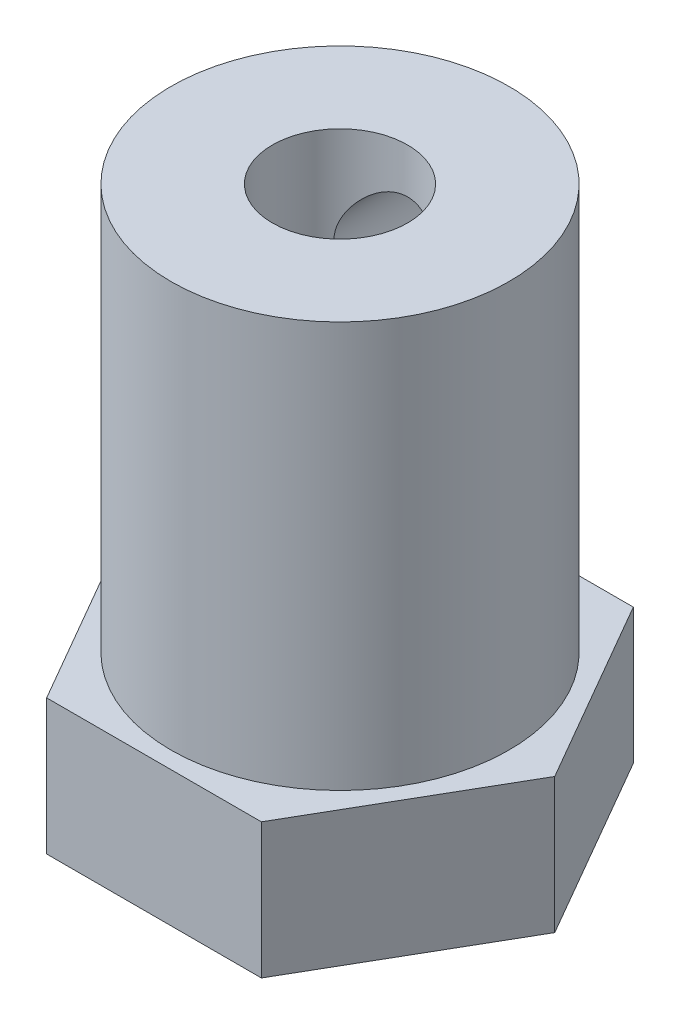
ISO-10303-21;
HEADER;
FILE_DESCRIPTION(('STEP AP214'),'2;1');
FILE_NAME('part.step','',(''),(''),'','','');
FILE_SCHEMA(('AUTOMOTIVE_DESIGN { 1 0 10303 214 1 1 1 1 }'));
ENDSEC;
DATA;
#1=APPLICATION_CONTEXT('core data for automotive mechanical design processes');
#2=APPLICATION_PROTOCOL_DEFINITION('international standard','automotive_design',2000,#1);
#3=PRODUCT_CONTEXT('',#1,'mechanical');
#4=PRODUCT('Part','Part','',(#3));
#5=PRODUCT_RELATED_PRODUCT_CATEGORY('part','',(#4));
#6=PRODUCT_DEFINITION_FORMATION('','',#4);
#7=PRODUCT_DEFINITION_CONTEXT('part definition',#1,'design');
#8=PRODUCT_DEFINITION('design','',#6,#7);
#9=PRODUCT_DEFINITION_SHAPE('','',#8);
#10=(LENGTH_UNIT() NAMED_UNIT(*) SI_UNIT(.MILLI.,.METRE.));
#11=(NAMED_UNIT(*) PLANE_ANGLE_UNIT() SI_UNIT($,.RADIAN.));
#12=(NAMED_UNIT(*) SI_UNIT($,.STERADIAN.) SOLID_ANGLE_UNIT());
#13=UNCERTAINTY_MEASURE_WITH_UNIT(LENGTH_MEASURE(1.E-05),#10,'distance_accuracy_value','');
#14=(GEOMETRIC_REPRESENTATION_CONTEXT(3) GLOBAL_UNCERTAINTY_ASSIGNED_CONTEXT((#13)) GLOBAL_UNIT_ASSIGNED_CONTEXT((#10,
#11,#12)) REPRESENTATION_CONTEXT('',''));
#15=CARTESIAN_POINT('',(0.,0.,0.));
#16=DIRECTION('',(0.,0.,1.));
#17=DIRECTION('',(1.,0.,0.));
#18=AXIS2_PLACEMENT_3D('',#15,#16,#17);
#19=CARTESIAN_POINT('',(3.175426480543,4.,5.49999999999996));
#20=DIRECTION('',(-0.866025403784442,0.,-0.499999999999995));
#21=DIRECTION('',(-0.499999999999995,0.,0.866025403784442));
#22=AXIS2_PLACEMENT_3D('',#19,#20,#21);
#23=PLANE('',#22);
#24=DIRECTION('',(0.499999999999995,0.,-0.866025403784442));
#25=VECTOR('',#24,1.);
#26=CARTESIAN_POINT('',(3.175426480543,0.,5.49999999999996));
#27=LINE('',#26,#25);
#28=CARTESIAN_POINT('',(3.175426480543,0.,5.49999999999996));
#29=VERTEX_POINT('',#28);
#30=CARTESIAN_POINT('',(6.35085296108588,0.,0.));
#31=VERTEX_POINT('',#30);
#32=EDGE_CURVE('E123',#29,#31,#27,.T.);
#33=ORIENTED_EDGE('',*,*,#32,.T.);
#34=DIRECTION('',(0.,-1.,0.));
#35=VECTOR('',#34,1.);
#36=CARTESIAN_POINT('',(6.35085296108588,4.,0.));
#37=LINE('',#36,#35);
#38=CARTESIAN_POINT('',(6.35085296108588,4.,0.));
#39=VERTEX_POINT('',#38);
#40=EDGE_CURVE('E11',#39,#31,#37,.T.);
#41=ORIENTED_EDGE('',*,*,#40,.F.);
#42=DIRECTION('',(0.499999999999995,0.,-0.866025403784442));
#43=VECTOR('',#42,1.);
#44=CARTESIAN_POINT('',(3.175426480543,4.,5.49999999999996));
#45=LINE('',#44,#43);
#46=CARTESIAN_POINT('',(3.175426480543,4.,5.49999999999996));
#47=VERTEX_POINT('',#46);
#48=EDGE_CURVE('E134',#47,#39,#45,.T.);
#49=ORIENTED_EDGE('',*,*,#48,.F.);
#50=DIRECTION('',(0.,-1.,0.));
#51=VECTOR('',#50,1.);
#52=CARTESIAN_POINT('',(3.175426480543,4.,5.49999999999996));
#53=LINE('',#52,#51);
#54=EDGE_CURVE('E119',#47,#29,#53,.T.);
#55=ORIENTED_EDGE('',*,*,#54,.T.);
#56=EDGE_LOOP('',(#33,#41,#49,#55));
#57=FACE_BOUND('',#56,.T.);
#58=ADVANCED_FACE('F32',(#57),#23,.F.);
#59=CARTESIAN_POINT('',(6.35085296108588,4.,0.));
#60=DIRECTION('',(-0.866025403784438,0.,0.500000000000001));
#61=DIRECTION('',(0.500000000000001,0.,0.866025403784438));
#62=AXIS2_PLACEMENT_3D('',#59,#60,#61);
#63=PLANE('',#62);
#64=DIRECTION('',(-0.500000000000001,0.,-0.866025403784438));
#65=VECTOR('',#64,1.);
#66=CARTESIAN_POINT('',(6.35085296108588,0.,0.));
#67=LINE('',#66,#65);
#68=CARTESIAN_POINT('',(3.17542648054293,0.,-5.5));
#69=VERTEX_POINT('',#68);
#70=EDGE_CURVE('E126',#31,#69,#67,.T.);
#71=ORIENTED_EDGE('',*,*,#70,.T.);
#72=DIRECTION('',(0.,-1.,0.));
#73=VECTOR('',#72,1.);
#74=CARTESIAN_POINT('',(3.17542648054293,4.,-5.5));
#75=LINE('',#74,#73);
#76=CARTESIAN_POINT('',(3.17542648054293,4.,-5.5));
#77=VERTEX_POINT('',#76);
#78=EDGE_CURVE('E46',#77,#69,#75,.T.);
#79=ORIENTED_EDGE('',*,*,#78,.F.);
#80=DIRECTION('',(-0.500000000000001,0.,-0.866025403784438));
#81=VECTOR('',#80,1.);
#82=CARTESIAN_POINT('',(6.35085296108588,4.,0.));
#83=LINE('',#82,#81);
#84=EDGE_CURVE('E92',#39,#77,#83,.T.);
#85=ORIENTED_EDGE('',*,*,#84,.F.);
#86=ORIENTED_EDGE('',*,*,#40,.T.);
#87=EDGE_LOOP('',(#71,#79,#85,#86));
#88=FACE_BOUND('',#87,.T.);
#89=ADVANCED_FACE('F164',(#88),#63,.F.);
#90=CARTESIAN_POINT('',(3.17542648054293,4.,-5.5));
#91=DIRECTION('',(0.,0.,1.));
#92=DIRECTION('',(1.,0.,0.));
#93=AXIS2_PLACEMENT_3D('',#90,#91,#92);
#94=PLANE('',#93);
#95=DIRECTION('',(-1.,0.,0.));
#96=VECTOR('',#95,1.);
#97=CARTESIAN_POINT('',(3.17542648054293,0.,-5.5));
#98=LINE('',#97,#96);
#99=CARTESIAN_POINT('',(-3.17542648054296,0.,-5.49999999999998));
#100=VERTEX_POINT('',#99);
#101=EDGE_CURVE('E129',#69,#100,#98,.T.);
#102=ORIENTED_EDGE('',*,*,#101,.T.);
#103=DIRECTION('',(0.,-1.,0.));
#104=VECTOR('',#103,1.);
#105=CARTESIAN_POINT('',(-3.17542648054296,4.,-5.49999999999998));
#106=LINE('',#105,#104);
#107=CARTESIAN_POINT('',(-3.17542648054296,4.,-5.49999999999998));
#108=VERTEX_POINT('',#107);
#109=EDGE_CURVE('E114',#108,#100,#106,.T.);
#110=ORIENTED_EDGE('',*,*,#109,.F.);
#111=DIRECTION('',(-1.,0.,0.));
#112=VECTOR('',#111,1.);
#113=CARTESIAN_POINT('',(3.17542648054293,4.,-5.5));
#114=LINE('',#113,#112);
#115=EDGE_CURVE('E105',#77,#108,#114,.T.);
#116=ORIENTED_EDGE('',*,*,#115,.F.);
#117=ORIENTED_EDGE('',*,*,#78,.T.);
#118=EDGE_LOOP('',(#102,#110,#116,#117));
#119=FACE_BOUND('',#118,.T.);
#120=ADVANCED_FACE('F167',(#119),#94,.F.);
#121=CARTESIAN_POINT('',(-3.17542648054296,4.,-5.49999999999998));
#122=DIRECTION('',(0.866025403784441,0.,0.499999999999995));
#123=DIRECTION('',(0.499999999999995,0.,-0.866025403784442));
#124=AXIS2_PLACEMENT_3D('',#121,#122,#123);
#125=PLANE('',#124);
#126=DIRECTION('',(-0.499999999999995,0.,0.866025403784441));
#127=VECTOR('',#126,1.);
#128=CARTESIAN_POINT('',(-3.17542648054296,0.,-5.49999999999998));
#129=LINE('',#128,#127);
#130=CARTESIAN_POINT('',(-6.35085296108588,0.,0.));
#131=VERTEX_POINT('',#130);
#132=EDGE_CURVE('E113',#100,#131,#129,.T.);
#133=ORIENTED_EDGE('',*,*,#132,.T.);
#134=DIRECTION('',(0.,-1.,0.));
#135=VECTOR('',#134,1.);
#136=CARTESIAN_POINT('',(-6.35085296108588,4.,0.));
#137=LINE('',#136,#135);
#138=CARTESIAN_POINT('',(-6.35085296108588,4.,0.));
#139=VERTEX_POINT('',#138);
#140=EDGE_CURVE('E110',#139,#131,#137,.T.);
#141=ORIENTED_EDGE('',*,*,#140,.F.);
#142=DIRECTION('',(-0.499999999999995,0.,0.866025403784441));
#143=VECTOR('',#142,1.);
#144=CARTESIAN_POINT('',(-3.17542648054296,4.,-5.49999999999998));
#145=LINE('',#144,#143);
#146=EDGE_CURVE('E99',#108,#139,#145,.T.);
#147=ORIENTED_EDGE('',*,*,#146,.F.);
#148=ORIENTED_EDGE('',*,*,#109,.T.);
#149=EDGE_LOOP('',(#133,#141,#147,#148));
#150=FACE_BOUND('',#149,.T.);
#151=ADVANCED_FACE('F111',(#150),#125,.F.);
#152=CARTESIAN_POINT('',(-6.35085296108588,4.,0.));
#153=DIRECTION('',(0.866025403784434,0.,-0.500000000000007));
#154=DIRECTION('',(-0.500000000000007,0.,-0.866025403784434));
#155=AXIS2_PLACEMENT_3D('',#152,#153,#154);
#156=PLANE('',#155);
#157=DIRECTION('',(0.500000000000007,0.,0.866025403784434));
#158=VECTOR('',#157,1.);
#159=CARTESIAN_POINT('',(-6.35085296108588,0.,0.));
#160=LINE('',#159,#158);
#161=CARTESIAN_POINT('',(-3.17542648054289,0.,5.50000000000002));
#162=VERTEX_POINT('',#161);
#163=EDGE_CURVE('E78',#131,#162,#160,.T.);
#164=ORIENTED_EDGE('',*,*,#163,.T.);
#165=DIRECTION('',(0.,-1.,0.));
#166=VECTOR('',#165,1.);
#167=CARTESIAN_POINT('',(-3.17542648054289,4.,5.50000000000002));
#168=LINE('',#167,#166);
#169=CARTESIAN_POINT('',(-3.17542648054289,4.,5.50000000000002));
#170=VERTEX_POINT('',#169);
#171=EDGE_CURVE('E115',#170,#162,#168,.T.);
#172=ORIENTED_EDGE('',*,*,#171,.F.);
#173=DIRECTION('',(0.500000000000007,0.,0.866025403784434));
#174=VECTOR('',#173,1.);
#175=CARTESIAN_POINT('',(-6.35085296108588,4.,0.));
#176=LINE('',#175,#174);
#177=EDGE_CURVE('E103',#139,#170,#176,.T.);
#178=ORIENTED_EDGE('',*,*,#177,.F.);
#179=ORIENTED_EDGE('',*,*,#140,.T.);
#180=EDGE_LOOP('',(#164,#172,#178,#179));
#181=FACE_BOUND('',#180,.T.);
#182=ADVANCED_FACE('F117',(#181),#156,.F.);
#183=CARTESIAN_POINT('',(-3.17542648054289,4.,5.50000000000002));
#184=DIRECTION('',(0.,0.,-1.));
#185=DIRECTION('',(-1.,0.,0.));
#186=AXIS2_PLACEMENT_3D('',#183,#184,#185);
#187=PLANE('',#186);
#188=DIRECTION('',(1.,0.,0.));
#189=VECTOR('',#188,1.);
#190=CARTESIAN_POINT('',(-3.17542648054289,0.,5.50000000000002));
#191=LINE('',#190,#189);
#192=EDGE_CURVE('E84',#162,#29,#191,.T.);
#193=ORIENTED_EDGE('',*,*,#192,.T.);
#194=ORIENTED_EDGE('',*,*,#54,.F.);
#195=DIRECTION('',(1.,0.,0.));
#196=VECTOR('',#195,1.);
#197=CARTESIAN_POINT('',(-3.17542648054289,4.,5.50000000000002));
#198=LINE('',#197,#196);
#199=EDGE_CURVE('E55',#170,#47,#198,.T.);
#200=ORIENTED_EDGE('',*,*,#199,.F.);
#201=ORIENTED_EDGE('',*,*,#171,.T.);
#202=EDGE_LOOP('',(#193,#194,#200,#201));
#203=FACE_BOUND('',#202,.T.);
#204=ADVANCED_FACE('F172',(#203),#187,.F.);
#205=CARTESIAN_POINT('',(0.,4.,0.));
#206=DIRECTION('',(0.,1.,0.));
#207=DIRECTION('',(0.,0.,1.));
#208=AXIS2_PLACEMENT_3D('',#205,#206,#207);
#209=PLANE('',#208);
#210=CARTESIAN_POINT('',(0.,4.,0.));
#211=DIRECTION('',(0.,1.,0.));
#212=DIRECTION('',(0.,0.,1.));
#213=AXIS2_PLACEMENT_3D('',#210,#211,#212);
#214=CIRCLE('',#213,5.);
#215=CARTESIAN_POINT('',(0.,4.,5.));
#216=VERTEX_POINT('',#215);
#217=EDGE_CURVE('E141',#216,#216,#214,.T.);
#218=ORIENTED_EDGE('',*,*,#217,.F.);
#219=EDGE_LOOP('',(#218));
#220=FACE_BOUND('',#219,.T.);
#221=ORIENTED_EDGE('',*,*,#48,.T.);
#222=ORIENTED_EDGE('',*,*,#84,.T.);
#223=ORIENTED_EDGE('',*,*,#115,.T.);
#224=ORIENTED_EDGE('',*,*,#146,.T.);
#225=ORIENTED_EDGE('',*,*,#177,.T.);
#226=ORIENTED_EDGE('',*,*,#199,.T.);
#227=EDGE_LOOP('',(#221,#222,#223,#224,#225,#226));
#228=FACE_BOUND('',#227,.T.);
#229=ADVANCED_FACE('F101',(#220,#228),#209,.T.);
#230=CARTESIAN_POINT('',(0.,0.,0.));
#231=DIRECTION('',(0.,1.,0.));
#232=DIRECTION('',(0.,0.,1.));
#233=AXIS2_PLACEMENT_3D('',#230,#231,#232);
#234=PLANE('',#233);
#235=CARTESIAN_POINT('',(0.,0.,0.));
#236=DIRECTION('',(0.,1.,0.));
#237=DIRECTION('',(0.,0.,1.));
#238=AXIS2_PLACEMENT_3D('',#235,#236,#237);
#239=CIRCLE('',#238,2.);
#240=CARTESIAN_POINT('',(0.,0.,2.));
#241=VERTEX_POINT('',#240);
#242=EDGE_CURVE('E142',#241,#241,#239,.T.);
#243=ORIENTED_EDGE('',*,*,#242,.T.);
#244=EDGE_LOOP('',(#243));
#245=FACE_BOUND('',#244,.T.);
#246=ORIENTED_EDGE('',*,*,#32,.F.);
#247=ORIENTED_EDGE('',*,*,#192,.F.);
#248=ORIENTED_EDGE('',*,*,#163,.F.);
#249=ORIENTED_EDGE('',*,*,#132,.F.);
#250=ORIENTED_EDGE('',*,*,#101,.F.);
#251=ORIENTED_EDGE('',*,*,#70,.F.);
#252=EDGE_LOOP('',(#246,#247,#248,#249,#250,#251));
#253=FACE_BOUND('',#252,.T.);
#254=ADVANCED_FACE('F170',(#245,#253),#234,.F.);
#255=CARTESIAN_POINT('',(0.,16.,0.));
#256=DIRECTION('',(0.,-1.,0.));
#257=DIRECTION('',(0.,0.,-1.));
#258=AXIS2_PLACEMENT_3D('',#255,#256,#257);
#259=CYLINDRICAL_SURFACE('',#258,5.);
#260=CARTESIAN_POINT('',(0.,14.6698123528721,-5.));
#261=CARTESIAN_POINT('',(-0.0822886127532999,14.6698113553872,-4.9999992925055));
#262=CARTESIAN_POINT('',(-0.164587318351529,14.6630184892481,-4.99794915693954));
#263=CARTESIAN_POINT('',(-0.32678812530488,14.63609099865,-4.98997105593691));
#264=CARTESIAN_POINT('',(-0.406689504411419,14.6159523948488,-4.98404193389692));
#265=CARTESIAN_POINT('',(-0.561732707754525,14.5630663359618,-4.96895552501836));
#266=CARTESIAN_POINT('',(-0.636881364395372,14.5303374832532,-4.95980300250425));
#267=CARTESIAN_POINT('',(-0.780624181053129,14.4532762598163,-4.93922109237645));
#268=CARTESIAN_POINT('',(-0.849217467469667,14.4089423454767,-4.92779140192067));
#269=CARTESIAN_POINT('',(-0.979871797183742,14.3085883453994,-4.90350737192774));
#270=CARTESIAN_POINT('',(-1.04171807124434,14.2522957269862,-4.89062383657036));
#271=CARTESIAN_POINT('',(-1.15524920923323,14.1302031229619,-4.86505834210442));
#272=CARTESIAN_POINT('',(-1.2069323632744,14.0644015407471,-4.85237641724502));
#273=CARTESIAN_POINT('',(-1.29980037723707,13.9233415998345,-4.82834113993772));
#274=CARTESIAN_POINT('',(-1.34072309022213,13.8479038918814,-4.81702406663875));
#275=CARTESIAN_POINT('',(-1.4092139477476,13.6908230986418,-4.79743620394031));
#276=CARTESIAN_POINT('',(-1.43678529919972,13.6091815089441,-4.78916468313311));
#277=CARTESIAN_POINT('',(-1.47701633682651,13.4444220867416,-4.77690870838434));
#278=CARTESIAN_POINT('',(-1.49007196234676,13.3614096090082,-4.77281069324534));
#279=CARTESIAN_POINT('',(-1.50213730614671,13.1942791966553,-4.76902789749768));
#280=CARTESIAN_POINT('',(-1.50115042761077,13.110161534813,-4.76934204760572));
#281=CARTESIAN_POINT('',(-1.48546977199811,12.9464284442636,-4.77424744067778));
#282=CARTESIAN_POINT('',(-1.47127205262684,12.8667601025099,-4.77868388599141));
#283=CARTESIAN_POINT('',(-1.43037420427055,12.7109925665986,-4.79108356228625));
#284=CARTESIAN_POINT('',(-1.4036728414164,12.6348937254978,-4.79904714132351));
#285=CARTESIAN_POINT('',(-1.3381602665368,12.4872120032114,-4.81772733074973));
#286=CARTESIAN_POINT('',(-1.29918816934641,12.4157052689168,-4.82848016115953));
#287=CARTESIAN_POINT('',(-1.21035222588682,12.2800803308619,-4.85150987000065));
#288=CARTESIAN_POINT('',(-1.16048574002587,12.2159639234583,-4.86378711746991));
#289=CARTESIAN_POINT('',(-1.04881290765545,12.0941261621101,-4.88911011297938));
#290=CARTESIAN_POINT('',(-0.986594907466954,12.0367836888424,-4.90216654310498));
#291=CARTESIAN_POINT('',(-0.853263259313947,11.9332583688078,-4.92712244063259));
#292=CARTESIAN_POINT('',(-0.782149051860868,11.8870762244577,-4.9390218351841));
#293=CARTESIAN_POINT('',(-0.632355038342782,11.8069524304074,-4.96043160069471));
#294=CARTESIAN_POINT('',(-0.553627749747929,11.7730948366222,-4.96992543668314));
#295=CARTESIAN_POINT('',(-0.391245415603498,11.7192127627725,-4.98533521832222));
#296=CARTESIAN_POINT('',(-0.307591751589561,11.6991844243396,-4.99125216186999));
#297=CARTESIAN_POINT('',(-0.140952242668311,11.6741601749727,-4.99868364643538));
#298=CARTESIAN_POINT('',(-0.0580500976011665,11.6686507670705,-5.0003485041779));
#299=CARTESIAN_POINT('',(0.107499605823403,11.6713815085842,-4.9995292324176));
#300=CARTESIAN_POINT('',(0.190147196690801,11.6796198225235,-4.99704565677756));
#301=CARTESIAN_POINT('',(0.350903605309717,11.7091969639836,-4.98830696987163));
#302=CARTESIAN_POINT('',(0.42907277261419,11.730235740453,-4.98213829799417));
#303=CARTESIAN_POINT('',(0.580754638954542,11.7844555856503,-4.96674347841532));
#304=CARTESIAN_POINT('',(0.654266777025603,11.81763811391,-4.95751696321085));
#305=CARTESIAN_POINT('',(0.796437189461071,11.8960655183532,-4.93669654351324));
#306=CARTESIAN_POINT('',(0.864943826199688,11.9415716938201,-4.92505280829675));
#307=CARTESIAN_POINT('',(0.993523307980165,12.0430371069249,-4.90073468764317));
#308=CARTESIAN_POINT('',(1.05359403235595,12.0989989647598,-4.8880600443108));
#309=CARTESIAN_POINT('',(1.16585744551029,12.2221996612415,-4.86253171869138));
#310=CARTESIAN_POINT('',(1.21768481231505,12.2897742286439,-4.84968825033267));
#311=CARTESIAN_POINT('',(1.30928995072155,12.4329402918856,-4.82576515238463));
#312=CARTESIAN_POINT('',(1.34906803829473,12.5085315774303,-4.81468547654651));
#313=CARTESIAN_POINT('',(1.4151734712717,12.6653448441268,-4.79567189615055));
#314=CARTESIAN_POINT('',(1.44156346937051,12.7465385394087,-4.78772337843827));
#315=CARTESIAN_POINT('',(1.48021730815115,12.9125003218036,-4.77591594362794));
#316=CARTESIAN_POINT('',(1.4924859897878,12.9972671736598,-4.772055625083));
#317=CARTESIAN_POINT('',(1.5022198448506,13.1641738712483,-4.76899972496087));
#318=CARTESIAN_POINT('',(1.50028055308491,13.2462760038897,-4.76961647442754));
#319=CARTESIAN_POINT('',(1.48307505444814,13.4089264562449,-4.77499401288294));
#320=CARTESIAN_POINT('',(1.46780938124717,13.4894748380485,-4.77975463592551));
#321=CARTESIAN_POINT('',(1.42476888804137,13.645757752015,-4.79275763670385));
#322=CARTESIAN_POINT('',(1.39715175507069,13.7215396402338,-4.80095604545964));
#323=CARTESIAN_POINT('',(1.3303150712113,13.8674547916898,-4.81990278909136));
#324=CARTESIAN_POINT('',(1.29109329962877,13.9375869705129,-4.83065161194312));
#325=CARTESIAN_POINT('',(1.20048763805072,14.0729754693992,-4.85397676425833));
#326=CARTESIAN_POINT('',(1.14871276092994,14.1379611141325,-4.86660540163797));
#327=CARTESIAN_POINT('',(1.03517434629782,14.25851485118,-4.89201320450026));
#328=CARTESIAN_POINT('',(0.973408217134503,14.3140804923399,-4.90479240823905));
#329=CARTESIAN_POINT('',(0.839465762183249,14.4158357651671,-4.92950936570649));
#330=CARTESIAN_POINT('',(0.767037885790608,14.4617037997276,-4.94141159765674));
#331=CARTESIAN_POINT('',(0.615141373983529,14.5405475227761,-4.96260680455813));
#332=CARTESIAN_POINT('',(0.535676052998954,14.5735292411466,-4.97190099931066));
#333=CARTESIAN_POINT('',(0.38075771265528,14.6227076285249,-4.98602174969301));
#334=CARTESIAN_POINT('',(0.305786961954233,14.6403240257554,-4.99122027381068));
#335=CARTESIAN_POINT('',(0.153880195230778,14.6638758781137,-4.99820944494492));
#336=CARTESIAN_POINT('',(0.076944509858139,14.6698132855769,-5.0000006615474));
#337=CARTESIAN_POINT('',(0.,14.6698123528721,-5.));
#338=B_SPLINE_CURVE_WITH_KNOTS('',3,(#260,#261,#262,#263,#264,#265,#266,#267,#268,#269,#270,
#271,#272,#273,#274,#275,#276,#277,#278,#279,#280,#281,#282,#283,#284,#285,#286,#287,#288,#289,
#290,#291,#292,#293,#294,#295,#296,#297,#298,#299,#300,#301,#302,#303,#304,#305,#306,#307,#308,
#309,#310,#311,#312,#313,#314,#315,#316,#317,#318,#319,#320,#321,#322,#323,#324,#325,#326,#327,
#328,#329,#330,#331,#332,#333,#334,#335,#336,#337),.UNSPECIFIED.,.T.,.F.,(4,2,2,2,2,2,2,2,2,2,2,
2,2,2,2,2,2,2,2,2,2,2,2,2,2,2,2,2,2,2,2,2,2,2,2,2,2,2,4),(0.,0.24658320361261,0.493239964845999,
0.739533676300873,0.985860164412701,1.23855602948191,1.49129437288633,1.74971481004109,
2.00807314543223,2.25919689356599,2.51025978319089,2.75226016697676,2.99428443658001,
3.23962426447119,3.48502360158555,3.74067104048167,3.99633456531072,4.25371046881689,
4.51101453528808,4.75908809438545,5.00712853550327,5.24956746682327,5.49203554593728,
5.74011305702908,5.98825282000191,6.24540400322819,6.5025484425268,6.75847814951252,
7.01432009460283,7.25950155466943,7.504673196616,7.74680040402721,7.98897397553107,
8.23996925679931,8.49102974897502,8.74942996156671,9.00770911595235,9.2383169193046,
9.46888616948874),.UNSPECIFIED.);
#339=CARTESIAN_POINT('',(0.,14.6698123528721,-5.));
#340=VERTEX_POINT('',#339);
#341=EDGE_CURVE('E148',#340,#340,#338,.T.);
#342=ORIENTED_EDGE('',*,*,#341,.T.);
#343=EDGE_LOOP('',(#342));
#344=FACE_BOUND('',#343,.T.);
#345=CARTESIAN_POINT('',(0.,16.,0.));
#346=DIRECTION('',(0.,1.,0.));
#347=DIRECTION('',(0.,0.,1.));
#348=AXIS2_PLACEMENT_3D('',#345,#346,#347);
#349=CIRCLE('',#348,5.);
#350=CARTESIAN_POINT('',(0.,16.,5.));
#351=VERTEX_POINT('',#350);
#352=EDGE_CURVE('E127',#351,#351,#349,.T.);
#353=ORIENTED_EDGE('',*,*,#352,.F.);
#354=EDGE_LOOP('',(#353));
#355=FACE_BOUND('',#354,.T.);
#356=ORIENTED_EDGE('',*,*,#217,.T.);
#357=EDGE_LOOP('',(#356));
#358=FACE_BOUND('',#357,.T.);
#359=ADVANCED_FACE('F220',(#344,#355,#358),#259,.T.);
#360=CARTESIAN_POINT('',(0.,16.,0.));
#361=DIRECTION('',(0.,1.,0.));
#362=DIRECTION('',(0.,0.,1.));
#363=AXIS2_PLACEMENT_3D('',#360,#361,#362);
#364=PLANE('',#363);
#365=CARTESIAN_POINT('',(0.,16.,0.));
#366=DIRECTION('',(0.,1.,0.));
#367=DIRECTION('',(0.,0.,1.));
#368=AXIS2_PLACEMENT_3D('',#365,#366,#367);
#369=CIRCLE('',#368,2.);
#370=CARTESIAN_POINT('',(0.,16.,2.));
#371=VERTEX_POINT('',#370);
#372=EDGE_CURVE('E139',#371,#371,#369,.T.);
#373=ORIENTED_EDGE('',*,*,#372,.F.);
#374=EDGE_LOOP('',(#373));
#375=FACE_BOUND('',#374,.T.);
#376=ORIENTED_EDGE('',*,*,#352,.T.);
#377=EDGE_LOOP('',(#376));
#378=FACE_BOUND('',#377,.T.);
#379=ADVANCED_FACE('F226',(#375,#378),#364,.T.);
#380=CARTESIAN_POINT('',(0.,0.,0.));
#381=DIRECTION('',(0.,1.,0.));
#382=DIRECTION('',(0.,0.,1.));
#383=AXIS2_PLACEMENT_3D('',#380,#381,#382);
#384=CYLINDRICAL_SURFACE('',#383,2.);
#385=CARTESIAN_POINT('',(1.50000000000001,13.1698123528721,-1.32287565553228));
#386=CARTESIAN_POINT('',(1.49999219049448,13.0998149294465,-1.32289190044094));
#387=CARTESIAN_POINT('',(1.49504109074421,13.0297665185602,-1.32856366615415));
#388=CARTESIAN_POINT('',(1.4757833321041,12.8924824966626,-1.349906440328));
#389=CARTESIAN_POINT('',(1.46144878565588,12.8252559078526,-1.36560725168669));
#390=CARTESIAN_POINT('',(1.42483838991847,12.6962325061337,-1.40375127916869));
#391=CARTESIAN_POINT('',(1.40267483444957,12.6343735761096,-1.42609848244813));
#392=CARTESIAN_POINT('',(1.35130655299364,12.5154668984269,-1.47486455031266));
#393=CARTESIAN_POINT('',(1.32210267801692,12.4584185704029,-1.50128292264931));
#394=CARTESIAN_POINT('',(1.25039909811055,12.3376995565555,-1.56177312961146));
#395=CARTESIAN_POINT('',(1.20639573950364,12.2751444186456,-1.59628904009786));
#396=CARTESIAN_POINT('',(1.10933596759309,12.1572868866298,-1.66521164096378));
#397=CARTESIAN_POINT('',(1.05626622282801,12.1019953880518,-1.69961809339876));
#398=CARTESIAN_POINT('',(0.929610192252527,11.9889536142166,-1.7726258243625));
#399=CARTESIAN_POINT('',(0.854047289142176,11.9330063861523,-1.81064921229758));
#400=CARTESIAN_POINT('',(0.691189714821953,11.8351901445893,-1.87882809751632));
#401=CARTESIAN_POINT('',(0.60392329383618,11.7932880554033,-1.90900204180106));
#402=CARTESIAN_POINT('',(0.447869023983659,11.7366046669692,-1.95034258990248));
#403=CARTESIAN_POINT('',(0.381446049692549,11.7174552568936,-1.96449710921006));
#404=CARTESIAN_POINT('',(0.245552609316556,11.6884222368754,-1.98605635937555));
#405=CARTESIAN_POINT('',(0.176084845995183,11.6785305767654,-1.99346695432364));
#406=CARTESIAN_POINT('',(0.0358650926220417,11.6685906190096,-2.00091375578087));
#407=CARTESIAN_POINT('',(-0.0348897591186252,11.6685678984957,-2.00093080057495));
#408=CARTESIAN_POINT('',(-0.175316156674023,11.6784302896524,-1.99354206503066));
#409=CARTESIAN_POINT('',(-0.244987447822213,11.6883176957802,-1.98613456571337));
#410=CARTESIAN_POINT('',(-0.378889193792638,11.716893403462,-1.96491377944411));
#411=CARTESIAN_POINT('',(-0.443224268236283,11.7352686792592,-1.9513285776568));
#412=CARTESIAN_POINT('',(-0.567680485046384,11.7798079950543,-1.91882278657017));
#413=CARTESIAN_POINT('',(-0.627800705033623,11.8059737333853,-1.89990103394194));
#414=CARTESIAN_POINT('',(-0.749216921864718,11.8683419680174,-1.85561045984505));
#415=CARTESIAN_POINT('',(-0.809935384713586,11.9053244494909,-1.82976540608098));
#416=CARTESIAN_POINT('',(-0.924567250548271,11.9865460568426,-1.7746070248374));
#417=CARTESIAN_POINT('',(-0.978474784621208,12.030791366572,-1.74529074780454));
#418=CARTESIAN_POINT('',(-1.08908204283327,12.135035701693,-1.67893765872361));
#419=CARTESIAN_POINT('',(-1.14424493004783,12.1964215628985,-1.64151655866369));
#420=CARTESIAN_POINT('',(-1.24400875556226,12.327646936494,-1.5672595828377));
#421=CARTESIAN_POINT('',(-1.28860466211476,12.3974904523972,-1.53042399363525));
#422=CARTESIAN_POINT('',(-1.35873206411599,12.5307942231177,-1.4681942599916));
#423=CARTESIAN_POINT('',(-1.38628866868101,12.5927993981728,-1.44197599789984));
#424=CARTESIAN_POINT('',(-1.43319397108783,12.7218776342915,-1.39536741257395));
#425=CARTESIAN_POINT('',(-1.45256121808258,12.7889388325625,-1.37496395320512));
#426=CARTESIAN_POINT('',(-1.47902385350668,12.9134992968704,-1.34640050620233));
#427=CARTESIAN_POINT('',(-1.48779069496581,12.970259434989,-1.33661539556871));
#428=CARTESIAN_POINT('',(-1.49871760619788,13.0851678190459,-1.32435588438335));
#429=CARTESIAN_POINT('',(-1.50088612873264,13.1433141927749,-1.32187213058308));
#430=CARTESIAN_POINT('',(-1.49845270115551,13.2592913446055,-1.32462868790498));
#431=CARTESIAN_POINT('',(-1.49384825899489,13.3171219986818,-1.32987184207165));
#432=CARTESIAN_POINT('',(-1.47822527271968,13.430888505315,-1.34721218775047));
#433=CARTESIAN_POINT('',(-1.46719578056393,13.4868209508202,-1.35932107727346));
#434=CARTESIAN_POINT('',(-1.43413959562386,13.616150397811,-1.39427758287803));
#435=CARTESIAN_POINT('',(-1.40954189769241,13.6882483067871,-1.41944823697316));
#436=CARTESIAN_POINT('',(-1.35088877838434,13.8261200165122,-1.47537861079977));
#437=CARTESIAN_POINT('',(-1.31681594335475,13.8918818701669,-1.50614858477231));
#438=CARTESIAN_POINT('',(-1.23869774116694,14.0191613609202,-1.57108282375651));
#439=CARTESIAN_POINT('',(-1.1943411006034,14.0804452290904,-1.60532883846047));
#440=CARTESIAN_POINT('',(-1.09682562914591,14.1958144492334,-1.67347506272362));
#441=CARTESIAN_POINT('',(-1.04366252194462,14.249896280861,-1.70737509574666));
#442=CARTESIAN_POINT('',(-0.916234513829602,14.3610893445015,-1.77960222623533));
#443=CARTESIAN_POINT('',(-0.839896270946837,14.4162875917297,-1.81728174165357));
#444=CARTESIAN_POINT('',(-0.675551612651248,14.512433086323,-1.88453104769826));
#445=CARTESIAN_POINT('',(-0.587571029974831,14.5534111774534,-1.91411836052284));
#446=CARTESIAN_POINT('',(-0.430755661496891,14.608250344319,-1.9541940640238));
#447=CARTESIAN_POINT('',(-0.364250057327452,14.6265691461475,-1.9677547802964));
#448=CARTESIAN_POINT('',(-0.228364464964332,14.6539411491796,-1.98810265589123));
#449=CARTESIAN_POINT('',(-0.158987104561923,14.6630026344206,-1.9948958710696));
#450=CARTESIAN_POINT('',(-0.0191476059403793,14.6713287438007,-2.00113566717062));
#451=CARTESIAN_POINT('',(0.0513166925871066,14.6705703702203,-2.00056500218907));
#452=CARTESIAN_POINT('',(0.191009011030099,14.6592513615709,-1.9920880324381));
#453=CARTESIAN_POINT('',(0.260236696591307,14.6486881151646,-1.98417977344351));
#454=CARTESIAN_POINT('',(0.393521935254989,14.6188374367049,-1.96203400925195));
#455=CARTESIAN_POINT('',(0.457671236511459,14.5998121715506,-1.94798690792878));
#456=CARTESIAN_POINT('',(0.581661343097406,14.5540242872532,-1.91462720575136));
#457=CARTESIAN_POINT('',(0.641501223388831,14.5272600130412,-1.89531347862386));
#458=CARTESIAN_POINT('',(0.762547698766829,14.4635344152761,-1.8501764221064));
#459=CARTESIAN_POINT('',(0.823141236713435,14.4257614215125,-1.8238635270758));
#460=CARTESIAN_POINT('',(0.937414811724232,14.3429459123179,-1.76785506075716));
#461=CARTESIAN_POINT('',(0.99108841238339,14.297896715586,-1.73815638795657));
#462=CARTESIAN_POINT('',(1.10112380660683,14.1918069863113,-1.67106353042105));
#463=CARTESIAN_POINT('',(1.15591691541997,14.1293659534322,-1.63330922504696));
#464=CARTESIAN_POINT('',(1.25475253429352,13.9959442809722,-1.55866082463331));
#465=CARTESIAN_POINT('',(1.2987911055673,13.9249605268355,-1.5217670492189));
#466=CARTESIAN_POINT('',(1.36695971301456,13.7909291022818,-1.46049601449283));
#467=CARTESIAN_POINT('',(1.39333526338,13.7294773701655,-1.43513625007635));
#468=CARTESIAN_POINT('',(1.438053980286,13.6017294398162,-1.39032564651231));
#469=CARTESIAN_POINT('',(1.45641847678345,13.5354466612766,-1.37085915899695));
#470=CARTESIAN_POINT('',(1.47997057756381,13.4190241332752,-1.34532423383261));
#471=CARTESIAN_POINT('',(1.48744249026868,13.3698452815816,-1.33700130265678));
#472=CARTESIAN_POINT('',(1.49745839072449,13.2703900198384,-1.32577295392453));
#473=CARTESIAN_POINT('',(1.50000561211715,13.2201143519284,-1.32286398151144));
#474=CARTESIAN_POINT('',(1.50000000000001,13.1698123528721,-1.32287565553228));
#475=B_SPLINE_CURVE_WITH_KNOTS('',3,(#385,#386,#387,#388,#389,#390,#391,#392,#393,#394,#395,
#396,#397,#398,#399,#400,#401,#402,#403,#404,#405,#406,#407,#408,#409,#410,#411,#412,#413,#414,
#415,#416,#417,#418,#419,#420,#421,#422,#423,#424,#425,#426,#427,#428,#429,#430,#431,#432,#433,
#434,#435,#436,#437,#438,#439,#440,#441,#442,#443,#444,#445,#446,#447,#448,#449,#450,#451,#452,
#453,#454,#455,#456,#457,#458,#459,#460,#461,#462,#463,#464,#465,#466,#467,#468,#469,#470,#471,
#472,#473,#474),.UNSPECIFIED.,.T.,.F.,(4,2,2,2,2,2,2,2,2,2,2,2,2,2,2,2,2,2,2,2,2,2,2,2,2,2,2,2,
2,2,2,2,2,2,2,2,2,2,2,2,2,2,2,2,4),(0.,0.209731776684488,0.420089722582993,0.627545385620137,
0.834975984672342,1.08585208691169,1.33710031031849,1.63964848103538,1.94147907444963,
2.15227725277555,2.36289195870711,2.57405250727807,2.78526195641288,2.9892375589505,
3.19325766108669,3.41936844116895,3.64567274887663,3.91649517204701,4.18744629647933,
4.40499409477196,4.62204646613006,4.79608005545901,4.96989060538193,5.14376512326213,
5.31793678696019,5.55730028202398,5.79710662639152,6.04543209090061,6.29387849446619,
6.59652499511464,6.89851088586566,7.10852896194427,7.31835893539181,7.52868041101044,
7.73905791773945,7.94332812691912,8.14764205379333,8.37510052489611,8.60276905744645,
8.87547580578156,9.14828228208532,9.36218279640836,9.57551025772699,9.72632812073767,
9.87704692032409),.UNSPECIFIED.);
#476=CARTESIAN_POINT('',(1.50000000000001,13.1698123528721,-1.32287565553228));
#477=VERTEX_POINT('',#476);
#478=EDGE_CURVE('E35',#477,#477,#475,.T.);
#479=ORIENTED_EDGE('',*,*,#478,.T.);
#480=EDGE_LOOP('',(#479));
#481=FACE_BOUND('',#480,.T.);
#482=ORIENTED_EDGE('',*,*,#372,.T.);
#483=EDGE_LOOP('',(#482));
#484=FACE_BOUND('',#483,.T.);
#485=ORIENTED_EDGE('',*,*,#242,.F.);
#486=EDGE_LOOP('',(#485));
#487=FACE_BOUND('',#486,.T.);
#488=ADVANCED_FACE('F231',(#481,#484,#487),#384,.F.);
#489=CARTESIAN_POINT('',(0.,13.1698123528721,-12.));
#490=DIRECTION('',(0.,0.,1.));
#491=DIRECTION('',(1.,0.,0.));
#492=AXIS2_PLACEMENT_3D('',#489,#490,#491);
#493=CYLINDRICAL_SURFACE('',#492,1.5);
#494=ORIENTED_EDGE('',*,*,#478,.F.);
#495=EDGE_LOOP('',(#494));
#496=FACE_BOUND('',#495,.T.);
#497=ORIENTED_EDGE('',*,*,#341,.F.);
#498=EDGE_LOOP('',(#497));
#499=FACE_BOUND('',#498,.T.);
#500=ADVANCED_FACE('F247',(#496,#499),#493,.F.);
#501=CLOSED_SHELL('',(#58,#89,#120,#151,#182,#204,#229,#254,#359,#379,#488,#500));
#502=MANIFOLD_SOLID_BREP('B2',#501);
#503=ADVANCED_BREP_SHAPE_REPRESENTATION('',(#18,#502),#14);
#504=SHAPE_DEFINITION_REPRESENTATION(#9,#503);
ENDSEC;
END-ISO-10303-21;
